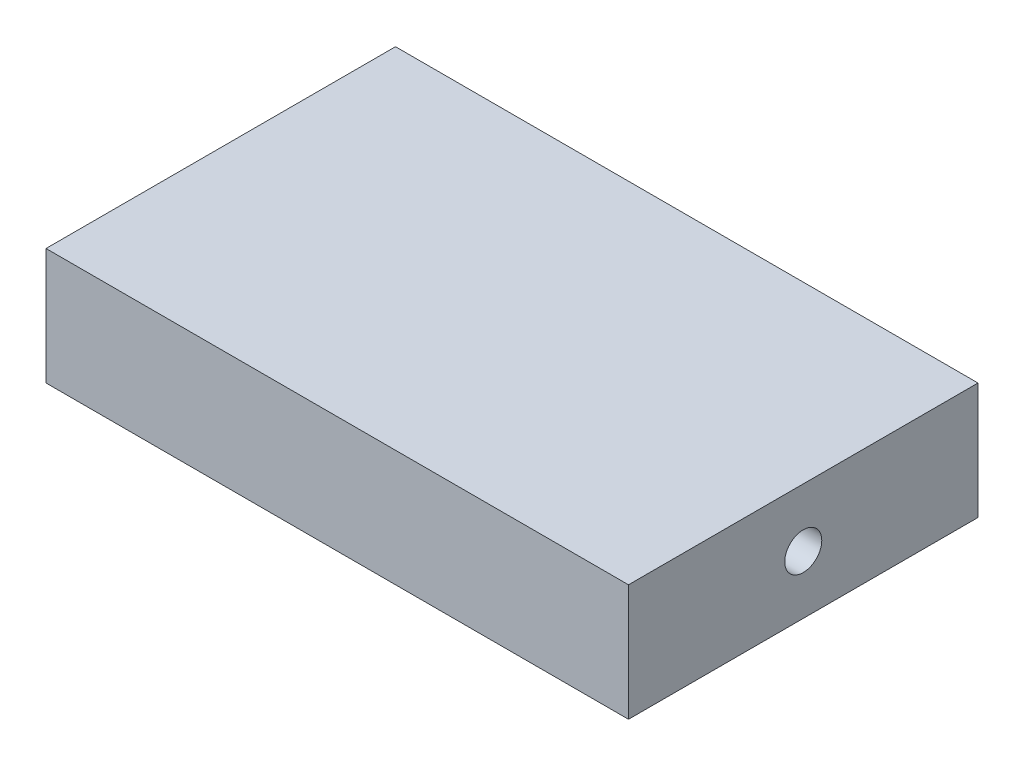
ISO-10303-21;
HEADER;
FILE_DESCRIPTION(('STEP AP214'),'2;1');
FILE_NAME('part.step','',(''),(''),'','','');
FILE_SCHEMA(('AUTOMOTIVE_DESIGN { 1 0 10303 214 1 1 1 1 }'));
ENDSEC;
DATA;
#1=APPLICATION_CONTEXT('core data for automotive mechanical design processes');
#2=APPLICATION_PROTOCOL_DEFINITION('international standard','automotive_design',2000,#1);
#3=PRODUCT_CONTEXT('',#1,'mechanical');
#4=PRODUCT('Part','Part','',(#3));
#5=PRODUCT_RELATED_PRODUCT_CATEGORY('part','',(#4));
#6=PRODUCT_DEFINITION_FORMATION('','',#4);
#7=PRODUCT_DEFINITION_CONTEXT('part definition',#1,'design');
#8=PRODUCT_DEFINITION('design','',#6,#7);
#9=PRODUCT_DEFINITION_SHAPE('','',#8);
#10=(LENGTH_UNIT() NAMED_UNIT(*) SI_UNIT(.MILLI.,.METRE.));
#11=(NAMED_UNIT(*) PLANE_ANGLE_UNIT() SI_UNIT($,.RADIAN.));
#12=(NAMED_UNIT(*) SI_UNIT($,.STERADIAN.) SOLID_ANGLE_UNIT());
#13=UNCERTAINTY_MEASURE_WITH_UNIT(LENGTH_MEASURE(1.E-05),#10,'distance_accuracy_value','');
#14=(GEOMETRIC_REPRESENTATION_CONTEXT(3) GLOBAL_UNCERTAINTY_ASSIGNED_CONTEXT((#13)) GLOBAL_UNIT_ASSIGNED_CONTEXT((#10,
#11,#12)) REPRESENTATION_CONTEXT('',''));
#15=CARTESIAN_POINT('',(0.,0.,0.));
#16=DIRECTION('',(0.,0.,1.));
#17=DIRECTION('',(1.,0.,0.));
#18=AXIS2_PLACEMENT_3D('',#15,#16,#17);
#19=CARTESIAN_POINT('',(31.75,12.7,19.05));
#20=DIRECTION('',(-1.,0.,0.));
#21=DIRECTION('',(0.,0.,1.));
#22=AXIS2_PLACEMENT_3D('',#19,#20,#21);
#23=PLANE('',#22);
#24=CARTESIAN_POINT('',(31.75,6.35,0.));
#25=DIRECTION('',(1.,0.,0.));
#26=DIRECTION('',(0.,0.,-1.));
#27=AXIS2_PLACEMENT_3D('',#24,#25,#26);
#28=CIRCLE('',#27,2.0193);
#29=CARTESIAN_POINT('',(31.75,6.35,-2.0193));
#30=VERTEX_POINT('',#29);
#31=EDGE_CURVE('E128',#30,#30,#28,.T.);
#32=ORIENTED_EDGE('',*,*,#31,.F.);
#33=EDGE_LOOP('',(#32));
#34=FACE_BOUND('',#33,.T.);
#35=DIRECTION('',(0.,0.,-1.));
#36=VECTOR('',#35,1.);
#37=CARTESIAN_POINT('',(31.75,0.,19.05));
#38=LINE('',#37,#36);
#39=CARTESIAN_POINT('',(31.75,0.,19.05));
#40=VERTEX_POINT('',#39);
#41=CARTESIAN_POINT('',(31.75,0.,-19.05));
#42=VERTEX_POINT('',#41);
#43=EDGE_CURVE('E138',#40,#42,#38,.T.);
#44=ORIENTED_EDGE('',*,*,#43,.T.);
#45=DIRECTION('',(0.,-1.,0.));
#46=VECTOR('',#45,1.);
#47=CARTESIAN_POINT('',(31.75,12.7,-19.05));
#48=LINE('',#47,#46);
#49=CARTESIAN_POINT('',(31.75,12.7,-19.05));
#50=VERTEX_POINT('',#49);
#51=EDGE_CURVE('E12',#50,#42,#48,.T.);
#52=ORIENTED_EDGE('',*,*,#51,.F.);
#53=DIRECTION('',(0.,0.,-1.));
#54=VECTOR('',#53,1.);
#55=CARTESIAN_POINT('',(31.75,12.7,19.05));
#56=LINE('',#55,#54);
#57=CARTESIAN_POINT('',(31.75,12.7,19.05));
#58=VERTEX_POINT('',#57);
#59=EDGE_CURVE('E139',#58,#50,#56,.T.);
#60=ORIENTED_EDGE('',*,*,#59,.F.);
#61=DIRECTION('',(0.,-1.,0.));
#62=VECTOR('',#61,1.);
#63=CARTESIAN_POINT('',(31.75,12.7,19.05));
#64=LINE('',#63,#62);
#65=EDGE_CURVE('E145',#58,#40,#64,.T.);
#66=ORIENTED_EDGE('',*,*,#65,.T.);
#67=EDGE_LOOP('',(#44,#52,#60,#66));
#68=FACE_BOUND('',#67,.T.);
#69=ADVANCED_FACE('F63',(#34,#68),#23,.F.);
#70=CARTESIAN_POINT('',(-31.75,12.7,-19.05));
#71=DIRECTION('',(0.,0.,1.));
#72=DIRECTION('',(1.,0.,0.));
#73=AXIS2_PLACEMENT_3D('',#70,#71,#72);
#74=PLANE('',#73);
#75=DIRECTION('',(-1.,0.,0.));
#76=VECTOR('',#75,1.);
#77=CARTESIAN_POINT('',(-31.75,0.,-19.05));
#78=LINE('',#77,#76);
#79=CARTESIAN_POINT('',(-31.75,0.,-19.05));
#80=VERTEX_POINT('',#79);
#81=EDGE_CURVE('E148',#42,#80,#78,.T.);
#82=ORIENTED_EDGE('',*,*,#81,.T.);
#83=DIRECTION('',(0.,-1.,0.));
#84=VECTOR('',#83,1.);
#85=CARTESIAN_POINT('',(-31.75,12.7,-19.05));
#86=LINE('',#85,#84);
#87=CARTESIAN_POINT('',(-31.75,12.7,-19.05));
#88=VERTEX_POINT('',#87);
#89=EDGE_CURVE('E71',#88,#80,#86,.T.);
#90=ORIENTED_EDGE('',*,*,#89,.F.);
#91=DIRECTION('',(-1.,0.,0.));
#92=VECTOR('',#91,1.);
#93=CARTESIAN_POINT('',(-31.75,12.7,-19.05));
#94=LINE('',#93,#92);
#95=EDGE_CURVE('E110',#50,#88,#94,.T.);
#96=ORIENTED_EDGE('',*,*,#95,.F.);
#97=ORIENTED_EDGE('',*,*,#51,.T.);
#98=EDGE_LOOP('',(#82,#90,#96,#97));
#99=FACE_BOUND('',#98,.T.);
#100=ADVANCED_FACE('F171',(#99),#74,.F.);
#101=CARTESIAN_POINT('',(-31.75,12.7,19.05));
#102=DIRECTION('',(1.,0.,0.));
#103=DIRECTION('',(0.,0.,-1.));
#104=AXIS2_PLACEMENT_3D('',#101,#102,#103);
#105=PLANE('',#104);
#106=CARTESIAN_POINT('',(-31.75,6.35,0.));
#107=DIRECTION('',(-1.,0.,0.));
#108=DIRECTION('',(0.,0.,1.));
#109=AXIS2_PLACEMENT_3D('',#106,#107,#108);
#110=CIRCLE('',#109,2.0193);
#111=CARTESIAN_POINT('',(-31.75,6.35,2.0193));
#112=VERTEX_POINT('',#111);
#113=EDGE_CURVE('E127',#112,#112,#110,.T.);
#114=ORIENTED_EDGE('',*,*,#113,.F.);
#115=EDGE_LOOP('',(#114));
#116=FACE_BOUND('',#115,.T.);
#117=DIRECTION('',(0.,0.,1.));
#118=VECTOR('',#117,1.);
#119=CARTESIAN_POINT('',(-31.75,0.,19.05));
#120=LINE('',#119,#118);
#121=CARTESIAN_POINT('',(-31.75,0.,19.05));
#122=VERTEX_POINT('',#121);
#123=EDGE_CURVE('E97',#80,#122,#120,.T.);
#124=ORIENTED_EDGE('',*,*,#123,.T.);
#125=DIRECTION('',(0.,-1.,0.));
#126=VECTOR('',#125,1.);
#127=CARTESIAN_POINT('',(-31.75,12.7,19.05));
#128=LINE('',#127,#126);
#129=CARTESIAN_POINT('',(-31.75,12.7,19.05));
#130=VERTEX_POINT('',#129);
#131=EDGE_CURVE('E153',#130,#122,#128,.T.);
#132=ORIENTED_EDGE('',*,*,#131,.F.);
#133=DIRECTION('',(0.,0.,1.));
#134=VECTOR('',#133,1.);
#135=CARTESIAN_POINT('',(-31.75,12.7,19.05));
#136=LINE('',#135,#134);
#137=EDGE_CURVE('E142',#88,#130,#136,.T.);
#138=ORIENTED_EDGE('',*,*,#137,.F.);
#139=ORIENTED_EDGE('',*,*,#89,.T.);
#140=EDGE_LOOP('',(#124,#132,#138,#139));
#141=FACE_BOUND('',#140,.T.);
#142=ADVANCED_FACE('F155',(#116,#141),#105,.F.);
#143=CARTESIAN_POINT('',(-31.75,12.7,19.05));
#144=DIRECTION('',(0.,0.,-1.));
#145=DIRECTION('',(-1.,0.,0.));
#146=AXIS2_PLACEMENT_3D('',#143,#144,#145);
#147=PLANE('',#146);
#148=DIRECTION('',(1.,0.,0.));
#149=VECTOR('',#148,1.);
#150=CARTESIAN_POINT('',(-31.75,0.,19.05));
#151=LINE('',#150,#149);
#152=EDGE_CURVE('E103',#122,#40,#151,.T.);
#153=ORIENTED_EDGE('',*,*,#152,.T.);
#154=ORIENTED_EDGE('',*,*,#65,.F.);
#155=DIRECTION('',(1.,0.,0.));
#156=VECTOR('',#155,1.);
#157=CARTESIAN_POINT('',(-31.75,12.7,19.05));
#158=LINE('',#157,#156);
#159=EDGE_CURVE('E79',#130,#58,#158,.T.);
#160=ORIENTED_EDGE('',*,*,#159,.F.);
#161=ORIENTED_EDGE('',*,*,#131,.T.);
#162=EDGE_LOOP('',(#153,#154,#160,#161));
#163=FACE_BOUND('',#162,.T.);
#164=ADVANCED_FACE('F162',(#163),#147,.F.);
#165=CARTESIAN_POINT('',(0.,12.7,0.));
#166=DIRECTION('',(0.,-1.,0.));
#167=DIRECTION('',(0.,0.,-1.));
#168=AXIS2_PLACEMENT_3D('',#165,#166,#167);
#169=PLANE('',#168);
#170=ORIENTED_EDGE('',*,*,#59,.T.);
#171=ORIENTED_EDGE('',*,*,#95,.T.);
#172=ORIENTED_EDGE('',*,*,#137,.T.);
#173=ORIENTED_EDGE('',*,*,#159,.T.);
#174=EDGE_LOOP('',(#170,#171,#172,#173));
#175=FACE_BOUND('',#174,.T.);
#176=ADVANCED_FACE('F164',(#175),#169,.F.);
#177=CARTESIAN_POINT('',(0.,0.,0.));
#178=DIRECTION('',(0.,-1.,0.));
#179=DIRECTION('',(0.,0.,-1.));
#180=AXIS2_PLACEMENT_3D('',#177,#178,#179);
#181=PLANE('',#180);
#182=ORIENTED_EDGE('',*,*,#43,.F.);
#183=ORIENTED_EDGE('',*,*,#152,.F.);
#184=ORIENTED_EDGE('',*,*,#123,.F.);
#185=ORIENTED_EDGE('',*,*,#81,.F.);
#186=EDGE_LOOP('',(#182,#183,#184,#185));
#187=FACE_BOUND('',#186,.T.);
#188=ADVANCED_FACE('F158',(#187),#181,.T.);
#189=CARTESIAN_POINT('',(-19.812,6.35,0.));
#190=DIRECTION('',(-1.,0.,0.));
#191=DIRECTION('',(0.,0.,1.));
#192=AXIS2_PLACEMENT_3D('',#189,#190,#191);
#193=CONICAL_SURFACE('',#192,2.0193,1.02974425867665);
#194=CARTESIAN_POINT('',(-18.5986821519977,6.35,0.));
#195=VERTEX_POINT('',#194);
#196=VERTEX_LOOP('',#195);
#197=FACE_BOUND('',#196,.T.);
#198=CARTESIAN_POINT('',(-19.812,6.35,0.));
#199=DIRECTION('',(-1.,0.,0.));
#200=DIRECTION('',(0.,0.,1.));
#201=AXIS2_PLACEMENT_3D('',#198,#199,#200);
#202=CIRCLE('',#201,2.0193);
#203=CARTESIAN_POINT('',(-19.812,6.35,2.0193));
#204=VERTEX_POINT('',#203);
#205=EDGE_CURVE('E131',#204,#204,#202,.T.);
#206=ORIENTED_EDGE('',*,*,#205,.T.);
#207=EDGE_LOOP('',(#206));
#208=FACE_BOUND('',#207,.T.);
#209=ADVANCED_FACE('F189',(#197,#208),#193,.F.);
#210=CARTESIAN_POINT('',(-31.75,6.35,0.));
#211=DIRECTION('',(-1.,0.,0.));
#212=DIRECTION('',(0.,0.,1.));
#213=AXIS2_PLACEMENT_3D('',#210,#211,#212);
#214=CYLINDRICAL_SURFACE('',#213,2.0193);
#215=ORIENTED_EDGE('',*,*,#205,.F.);
#216=EDGE_LOOP('',(#215));
#217=FACE_BOUND('',#216,.T.);
#218=ORIENTED_EDGE('',*,*,#113,.T.);
#219=EDGE_LOOP('',(#218));
#220=FACE_BOUND('',#219,.T.);
#221=ADVANCED_FACE('F121',(#217,#220),#214,.F.);
#222=CARTESIAN_POINT('',(19.812,6.35,0.));
#223=DIRECTION('',(1.,0.,0.));
#224=DIRECTION('',(0.,0.,-1.));
#225=AXIS2_PLACEMENT_3D('',#222,#223,#224);
#226=CONICAL_SURFACE('',#225,2.0193,1.02974425867665);
#227=CARTESIAN_POINT('',(18.5986821519977,6.35,0.));
#228=VERTEX_POINT('',#227);
#229=VERTEX_LOOP('',#228);
#230=FACE_BOUND('',#229,.T.);
#231=CARTESIAN_POINT('',(19.812,6.35,0.));
#232=DIRECTION('',(1.,0.,0.));
#233=DIRECTION('',(0.,0.,-1.));
#234=AXIS2_PLACEMENT_3D('',#231,#232,#233);
#235=CIRCLE('',#234,2.0193);
#236=CARTESIAN_POINT('',(19.812,6.35,-2.0193));
#237=VERTEX_POINT('',#236);
#238=EDGE_CURVE('E125',#237,#237,#235,.T.);
#239=ORIENTED_EDGE('',*,*,#238,.T.);
#240=EDGE_LOOP('',(#239));
#241=FACE_BOUND('',#240,.T.);
#242=ADVANCED_FACE('F117',(#230,#241),#226,.F.);
#243=CARTESIAN_POINT('',(31.75,6.35,0.));
#244=DIRECTION('',(1.,0.,0.));
#245=DIRECTION('',(0.,0.,-1.));
#246=AXIS2_PLACEMENT_3D('',#243,#244,#245);
#247=CYLINDRICAL_SURFACE('',#246,2.0193);
#248=ORIENTED_EDGE('',*,*,#238,.F.);
#249=EDGE_LOOP('',(#248));
#250=FACE_BOUND('',#249,.T.);
#251=ORIENTED_EDGE('',*,*,#31,.T.);
#252=EDGE_LOOP('',(#251));
#253=FACE_BOUND('',#252,.T.);
#254=ADVANCED_FACE('F120',(#250,#253),#247,.F.);
#255=CLOSED_SHELL('',(#69,#100,#142,#164,#176,#188,#209,#221,#242,#254));
#256=MANIFOLD_SOLID_BREP('B2',#255);
#257=ADVANCED_BREP_SHAPE_REPRESENTATION('',(#18,#256),#14);
#258=SHAPE_DEFINITION_REPRESENTATION(#9,#257);
ENDSEC;
END-ISO-10303-21;
